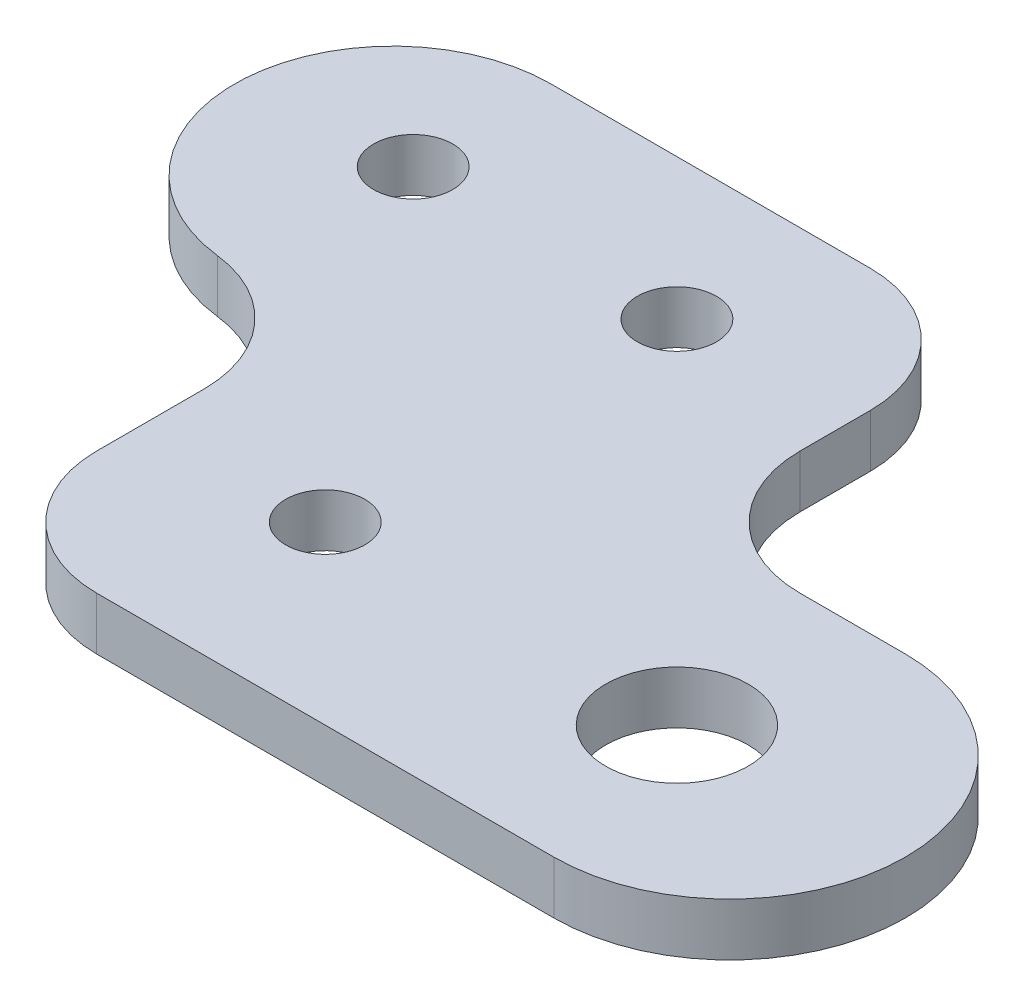
ISO-10303-21;
HEADER;
FILE_DESCRIPTION(('STEP AP214'),'2;1');
FILE_NAME('part.step','',(''),(''),'','','');
FILE_SCHEMA(('AUTOMOTIVE_DESIGN { 1 0 10303 214 1 1 1 1 }'));
ENDSEC;
DATA;
#1=APPLICATION_CONTEXT('core data for automotive mechanical design processes');
#2=APPLICATION_PROTOCOL_DEFINITION('international standard','automotive_design',2000,#1);
#3=PRODUCT_CONTEXT('',#1,'mechanical');
#4=PRODUCT('Part','Part','',(#3));
#5=PRODUCT_RELATED_PRODUCT_CATEGORY('part','',(#4));
#6=PRODUCT_DEFINITION_FORMATION('','',#4);
#7=PRODUCT_DEFINITION_CONTEXT('part definition',#1,'design');
#8=PRODUCT_DEFINITION('design','',#6,#7);
#9=PRODUCT_DEFINITION_SHAPE('','',#8);
#10=(LENGTH_UNIT() NAMED_UNIT(*) SI_UNIT(.MILLI.,.METRE.));
#11=(NAMED_UNIT(*) PLANE_ANGLE_UNIT() SI_UNIT($,.RADIAN.));
#12=(NAMED_UNIT(*) SI_UNIT($,.STERADIAN.) SOLID_ANGLE_UNIT());
#13=UNCERTAINTY_MEASURE_WITH_UNIT(LENGTH_MEASURE(1.E-05),#10,'distance_accuracy_value','');
#14=(GEOMETRIC_REPRESENTATION_CONTEXT(3) GLOBAL_UNCERTAINTY_ASSIGNED_CONTEXT((#13)) GLOBAL_UNIT_ASSIGNED_CONTEXT((#10,
#11,#12)) REPRESENTATION_CONTEXT('',''));
#15=CARTESIAN_POINT('',(0.,0.,0.));
#16=DIRECTION('',(0.,0.,1.));
#17=DIRECTION('',(1.,0.,0.));
#18=AXIS2_PLACEMENT_3D('',#15,#16,#17);
#19=CARTESIAN_POINT('',(6.500000000005,-1.500057886007,13.));
#20=DIRECTION('',(0.,-1.,0.));
#21=DIRECTION('',(0.,0.,-1.));
#22=AXIS2_PLACEMENT_3D('',#19,#20,#21);
#23=PLANE('',#22);
#24=CARTESIAN_POINT('',(16.,-1.500057886007,13.));
#25=DIRECTION('',(0.,-1.,0.));
#26=DIRECTION('',(0.,0.,-1.));
#27=AXIS2_PLACEMENT_3D('',#24,#25,#26);
#28=CIRCLE('',#27,4.05);
#29=CARTESIAN_POINT('',(16.,-1.500057886007,8.95));
#30=VERTEX_POINT('',#29);
#31=EDGE_CURVE('E167',#30,#30,#28,.T.);
#32=ORIENTED_EDGE('',*,*,#31,.T.);
#33=EDGE_LOOP('',(#32));
#34=FACE_BOUND('',#33,.T.);
#35=CARTESIAN_POINT('',(-19.,-1.500057886007,-7.));
#36=DIRECTION('',(0.,-1.,0.));
#37=DIRECTION('',(0.,0.,-1.));
#38=AXIS2_PLACEMENT_3D('',#35,#36,#37);
#39=CIRCLE('',#38,2.25);
#40=CARTESIAN_POINT('',(-19.,-1.500057886007,-9.25));
#41=VERTEX_POINT('',#40);
#42=EDGE_CURVE('E170',#41,#41,#39,.T.);
#43=ORIENTED_EDGE('',*,*,#42,.T.);
#44=EDGE_LOOP('',(#43));
#45=FACE_BOUND('',#44,.T.);
#46=CARTESIAN_POINT('',(-3.999999999995,-1.500057886007,13.));
#47=DIRECTION('',(0.,-1.,0.));
#48=DIRECTION('',(0.,0.,-1.));
#49=AXIS2_PLACEMENT_3D('',#46,#47,#48);
#50=CIRCLE('',#49,2.25);
#51=CARTESIAN_POINT('',(-3.999999999995,-1.500057886007,10.75));
#52=VERTEX_POINT('',#51);
#53=EDGE_CURVE('E173',#52,#52,#50,.T.);
#54=ORIENTED_EDGE('',*,*,#53,.T.);
#55=EDGE_LOOP('',(#54));
#56=FACE_BOUND('',#55,.T.);
#57=CARTESIAN_POINT('',(-3.999999999995,-1.500057886007,-7.));
#58=DIRECTION('',(0.,-1.,0.));
#59=DIRECTION('',(0.,0.,-1.));
#60=AXIS2_PLACEMENT_3D('',#57,#58,#59);
#61=CIRCLE('',#60,2.25);
#62=CARTESIAN_POINT('',(-3.999999999995,-1.500057886007,-9.25));
#63=VERTEX_POINT('',#62);
#64=EDGE_CURVE('E125',#63,#63,#61,.T.);
#65=ORIENTED_EDGE('',*,*,#64,.T.);
#66=EDGE_LOOP('',(#65));
#67=FACE_BOUND('',#66,.T.);
#68=CARTESIAN_POINT('',(-21.,-1.500057886007,9.893847866392));
#69=DIRECTION('',(0.,1.,0.));
#70=DIRECTION('',(0.,0.,1.));
#71=AXIS2_PLACEMENT_3D('',#68,#69,#70);
#72=CIRCLE('',#71,7.);
#73=CARTESIAN_POINT('',(-20.195000000025,-1.500057886007,2.94028942484258));
#74=VERTEX_POINT('',#73);
#75=CARTESIAN_POINT('',(-13.999999999995,-1.500057886007,9.893847866392));
#76=VERTEX_POINT('',#75);
#77=EDGE_CURVE('E133',#74,#76,#72,.F.);
#78=ORIENTED_EDGE('',*,*,#77,.T.);
#79=DIRECTION('',(0.,0.,1.));
#80=VECTOR('',#79,1.);
#81=CARTESIAN_POINT('',(-13.99999999999,-1.500057886007,23.));
#82=LINE('',#81,#80);
#83=CARTESIAN_POINT('',(-13.99999999999,-1.500057886007,16.));
#84=VERTEX_POINT('',#83);
#85=EDGE_CURVE('E130',#84,#76,#82,.F.);
#86=ORIENTED_EDGE('',*,*,#85,.F.);
#87=CARTESIAN_POINT('',(-6.999999999995,-1.500057886007,16.));
#88=DIRECTION('',(0.,1.,0.));
#89=DIRECTION('',(0.,0.,1.));
#90=AXIS2_PLACEMENT_3D('',#87,#88,#89);
#91=CIRCLE('',#90,7.);
#92=CARTESIAN_POINT('',(-6.999999999995,-1.500057886007,23.));
#93=VERTEX_POINT('',#92);
#94=EDGE_CURVE('E187',#93,#84,#91,.F.);
#95=ORIENTED_EDGE('',*,*,#94,.F.);
#96=DIRECTION('',(1.,0.,0.));
#97=VECTOR('',#96,1.);
#98=CARTESIAN_POINT('',(29.,-1.500057886007,23.));
#99=LINE('',#98,#97);
#100=CARTESIAN_POINT('',(19.,-1.500057886007,23.));
#101=VERTEX_POINT('',#100);
#102=EDGE_CURVE('E135',#101,#93,#99,.F.);
#103=ORIENTED_EDGE('',*,*,#102,.F.);
#104=CARTESIAN_POINT('',(19.,-1.500057886007,13.));
#105=DIRECTION('',(0.,-1.,0.));
#106=DIRECTION('',(0.,0.,-1.));
#107=AXIS2_PLACEMENT_3D('',#104,#105,#106);
#108=CIRCLE('',#107,10.);
#109=CARTESIAN_POINT('',(19.,-1.500057886007,3.));
#110=VERTEX_POINT('',#109);
#111=EDGE_CURVE('E110',#110,#101,#108,.T.);
#112=ORIENTED_EDGE('',*,*,#111,.F.);
#113=DIRECTION('',(-1.,0.,0.));
#114=VECTOR('',#113,1.);
#115=CARTESIAN_POINT('',(-15.99999999999,-1.500057886007,3.));
#116=LINE('',#115,#114);
#117=CARTESIAN_POINT('',(13.000000000005,-1.500057886007,3.));
#118=VERTEX_POINT('',#117);
#119=EDGE_CURVE('E108',#118,#110,#116,.F.);
#120=ORIENTED_EDGE('',*,*,#119,.F.);
#121=CARTESIAN_POINT('',(13.00000000001,-1.500057886007,-4.));
#122=DIRECTION('',(0.,-1.,0.));
#123=DIRECTION('',(0.,0.,-1.));
#124=AXIS2_PLACEMENT_3D('',#121,#122,#123);
#125=CIRCLE('',#124,7.);
#126=CARTESIAN_POINT('',(6.000000000005,-1.500057886007,-4.));
#127=VERTEX_POINT('',#126);
#128=EDGE_CURVE('E20',#118,#127,#125,.T.);
#129=ORIENTED_EDGE('',*,*,#128,.T.);
#130=DIRECTION('',(0.,0.,-1.));
#131=VECTOR('',#130,1.);
#132=CARTESIAN_POINT('',(6.000000000005,-1.500057886007,-17.));
#133=LINE('',#132,#131);
#134=CARTESIAN_POINT('',(6.000000000005,-1.500057886007,-8.));
#135=VERTEX_POINT('',#134);
#136=EDGE_CURVE('E123',#135,#127,#133,.F.);
#137=ORIENTED_EDGE('',*,*,#136,.F.);
#138=CARTESIAN_POINT('',(-0.999999999995,-1.500057886007,-8.));
#139=DIRECTION('',(0.,1.,0.));
#140=DIRECTION('',(0.,0.,1.));
#141=AXIS2_PLACEMENT_3D('',#138,#139,#140);
#142=CIRCLE('',#141,7.);
#143=CARTESIAN_POINT('',(-0.999999999994999,-1.500057886007,-15.));
#144=VERTEX_POINT('',#143);
#145=EDGE_CURVE('E178',#144,#135,#142,.F.);
#146=ORIENTED_EDGE('',*,*,#145,.F.);
#147=DIRECTION('',(-1.,0.,0.));
#148=VECTOR('',#147,1.);
#149=CARTESIAN_POINT('',(-28.16,-1.500057886007,-15.));
#150=LINE('',#149,#148);
#151=CARTESIAN_POINT('',(-19.159999999995,-1.500057886007,-15.));
#152=VERTEX_POINT('',#151);
#153=EDGE_CURVE('E126',#152,#144,#150,.F.);
#154=ORIENTED_EDGE('',*,*,#153,.F.);
#155=CARTESIAN_POINT('',(-19.16,-1.500057886007,-6.));
#156=DIRECTION('',(0.,-1.,0.));
#157=DIRECTION('',(0.,0.,-1.));
#158=AXIS2_PLACEMENT_3D('',#155,#156,#157);
#159=CIRCLE('',#158,9.);
#160=EDGE_CURVE('E182',#74,#152,#159,.T.);
#161=ORIENTED_EDGE('',*,*,#160,.F.);
#162=EDGE_LOOP('',(#78,#86,#95,#103,#112,#120,#129,#137,#146,#154,#161));
#163=FACE_BOUND('',#162,.T.);
#164=ADVANCED_FACE('F17',(#34,#45,#56,#67,#163),#23,.F.);
#165=CARTESIAN_POINT('',(13.00000000001,7.422742113993,-4.));
#166=DIRECTION('',(0.,-1.,0.));
#167=DIRECTION('',(0.,0.,-1.));
#168=AXIS2_PLACEMENT_3D('',#165,#166,#167);
#169=CYLINDRICAL_SURFACE('',#168,7.);
#170=ORIENTED_EDGE('',*,*,#128,.F.);
#171=DIRECTION('',(0.,1.,0.));
#172=VECTOR('',#171,1.);
#173=CARTESIAN_POINT('',(13.,-1.500057886007,3.));
#174=LINE('',#173,#172);
#175=CARTESIAN_POINT('',(13.000000000005,-4.500057886007,3.));
#176=VERTEX_POINT('',#175);
#177=EDGE_CURVE('E100',#176,#118,#174,.T.);
#178=ORIENTED_EDGE('',*,*,#177,.F.);
#179=CARTESIAN_POINT('',(13.00000000001,-4.500057886007,-4.));
#180=DIRECTION('',(0.,-1.,0.));
#181=DIRECTION('',(0.,0.,-1.));
#182=AXIS2_PLACEMENT_3D('',#179,#180,#181);
#183=CIRCLE('',#182,7.);
#184=CARTESIAN_POINT('',(6.000000000005,-4.500057886007,-4.));
#185=VERTEX_POINT('',#184);
#186=EDGE_CURVE('E165',#185,#176,#183,.F.);
#187=ORIENTED_EDGE('',*,*,#186,.F.);
#188=DIRECTION('',(0.,1.,0.));
#189=VECTOR('',#188,1.);
#190=CARTESIAN_POINT('',(6.000000000005,-6.500057886007,-4.));
#191=LINE('',#190,#189);
#192=EDGE_CURVE('E103',#127,#185,#191,.F.);
#193=ORIENTED_EDGE('',*,*,#192,.F.);
#194=EDGE_LOOP('',(#170,#178,#187,#193));
#195=FACE_BOUND('',#194,.T.);
#196=ADVANCED_FACE('F98',(#195),#169,.F.);
#197=CARTESIAN_POINT('',(-15.99999999999,-1.500057886007,3.));
#198=DIRECTION('',(0.,0.,-1.));
#199=DIRECTION('',(-1.,0.,0.));
#200=AXIS2_PLACEMENT_3D('',#197,#198,#199);
#201=PLANE('',#200);
#202=ORIENTED_EDGE('',*,*,#177,.T.);
#203=ORIENTED_EDGE('',*,*,#119,.T.);
#204=DIRECTION('',(0.,1.,0.));
#205=VECTOR('',#204,1.);
#206=CARTESIAN_POINT('',(19.,-1.500057886007,3.));
#207=LINE('',#206,#205);
#208=CARTESIAN_POINT('',(19.,-4.500057886007,3.));
#209=VERTEX_POINT('',#208);
#210=EDGE_CURVE('E189',#209,#110,#207,.T.);
#211=ORIENTED_EDGE('',*,*,#210,.F.);
#212=DIRECTION('',(1.,0.,0.));
#213=VECTOR('',#212,1.);
#214=CARTESIAN_POINT('',(6.500000000005,-4.500057886007,3.));
#215=LINE('',#214,#213);
#216=EDGE_CURVE('E116',#176,#209,#215,.T.);
#217=ORIENTED_EDGE('',*,*,#216,.F.);
#218=EDGE_LOOP('',(#202,#203,#211,#217));
#219=FACE_BOUND('',#218,.T.);
#220=ADVANCED_FACE('F114',(#219),#201,.T.);
#221=CARTESIAN_POINT('',(19.,5.017942113993,13.));
#222=DIRECTION('',(0.,-1.,0.));
#223=DIRECTION('',(0.,0.,-1.));
#224=AXIS2_PLACEMENT_3D('',#221,#222,#223);
#225=CYLINDRICAL_SURFACE('',#224,10.);
#226=CARTESIAN_POINT('',(19.,-4.500057886007,13.));
#227=DIRECTION('',(0.,-1.,0.));
#228=DIRECTION('',(0.,0.,-1.));
#229=AXIS2_PLACEMENT_3D('',#226,#227,#228);
#230=CIRCLE('',#229,10.);
#231=CARTESIAN_POINT('',(19.,-4.500057886007,23.));
#232=VERTEX_POINT('',#231);
#233=EDGE_CURVE('E162',#209,#232,#230,.T.);
#234=ORIENTED_EDGE('',*,*,#233,.F.);
#235=ORIENTED_EDGE('',*,*,#210,.T.);
#236=ORIENTED_EDGE('',*,*,#111,.T.);
#237=DIRECTION('',(0.,1.,0.));
#238=VECTOR('',#237,1.);
#239=CARTESIAN_POINT('',(19.,-1.500057886007,23.));
#240=LINE('',#239,#238);
#241=EDGE_CURVE('E121',#232,#101,#240,.T.);
#242=ORIENTED_EDGE('',*,*,#241,.F.);
#243=EDGE_LOOP('',(#234,#235,#236,#242));
#244=FACE_BOUND('',#243,.T.);
#245=ADVANCED_FACE('F192',(#244),#225,.T.);
#246=CARTESIAN_POINT('',(29.,-1.500057886007,23.));
#247=DIRECTION('',(0.,0.,1.));
#248=DIRECTION('',(1.,0.,0.));
#249=AXIS2_PLACEMENT_3D('',#246,#247,#248);
#250=PLANE('',#249);
#251=DIRECTION('',(0.,1.,0.));
#252=VECTOR('',#251,1.);
#253=CARTESIAN_POINT('',(-6.999999999995,-15.42285788601,23.));
#254=LINE('',#253,#252);
#255=CARTESIAN_POINT('',(-6.999999999995,-4.500057886007,23.));
#256=VERTEX_POINT('',#255);
#257=EDGE_CURVE('E136',#256,#93,#254,.T.);
#258=ORIENTED_EDGE('',*,*,#257,.F.);
#259=DIRECTION('',(1.,0.,0.));
#260=VECTOR('',#259,1.);
#261=CARTESIAN_POINT('',(6.500000000005,-4.500057886007,23.));
#262=LINE('',#261,#260);
#263=EDGE_CURVE('E161',#232,#256,#262,.F.);
#264=ORIENTED_EDGE('',*,*,#263,.F.);
#265=ORIENTED_EDGE('',*,*,#241,.T.);
#266=ORIENTED_EDGE('',*,*,#102,.T.);
#267=EDGE_LOOP('',(#258,#264,#265,#266));
#268=FACE_BOUND('',#267,.T.);
#269=ADVANCED_FACE('F199',(#268),#250,.T.);
#270=CARTESIAN_POINT('',(-6.999999999995,-15.42285788601,16.));
#271=DIRECTION('',(0.,1.,0.));
#272=DIRECTION('',(0.,0.,1.));
#273=AXIS2_PLACEMENT_3D('',#270,#271,#272);
#274=CYLINDRICAL_SURFACE('',#273,7.);
#275=ORIENTED_EDGE('',*,*,#94,.T.);
#276=DIRECTION('',(0.,1.,0.));
#277=VECTOR('',#276,1.);
#278=CARTESIAN_POINT('',(-13.99999999999,-1.500057886007,16.));
#279=LINE('',#278,#277);
#280=CARTESIAN_POINT('',(-13.999999999995,-4.500057886007,16.));
#281=VERTEX_POINT('',#280);
#282=EDGE_CURVE('E134',#281,#84,#279,.T.);
#283=ORIENTED_EDGE('',*,*,#282,.F.);
#284=CARTESIAN_POINT('',(-6.999999999995,-4.500057886007,16.));
#285=DIRECTION('',(0.,1.,0.));
#286=DIRECTION('',(0.,0.,1.));
#287=AXIS2_PLACEMENT_3D('',#284,#285,#286);
#288=CIRCLE('',#287,7.);
#289=EDGE_CURVE('E158',#256,#281,#288,.F.);
#290=ORIENTED_EDGE('',*,*,#289,.F.);
#291=ORIENTED_EDGE('',*,*,#257,.T.);
#292=EDGE_LOOP('',(#275,#283,#290,#291));
#293=FACE_BOUND('',#292,.T.);
#294=ADVANCED_FACE('F218',(#293),#274,.T.);
#295=CARTESIAN_POINT('',(-13.99999999999,-1.500057886007,23.));
#296=DIRECTION('',(-1.,0.,0.));
#297=DIRECTION('',(0.,0.,1.));
#298=AXIS2_PLACEMENT_3D('',#295,#296,#297);
#299=PLANE('',#298);
#300=ORIENTED_EDGE('',*,*,#282,.T.);
#301=ORIENTED_EDGE('',*,*,#85,.T.);
#302=DIRECTION('',(0.,1.,0.));
#303=VECTOR('',#302,1.);
#304=CARTESIAN_POINT('',(-14.,-15.42285788601,9.893847866392));
#305=LINE('',#304,#303);
#306=CARTESIAN_POINT('',(-14.,-4.500057886007,9.893847866392));
#307=VERTEX_POINT('',#306);
#308=EDGE_CURVE('E186',#76,#307,#305,.F.);
#309=ORIENTED_EDGE('',*,*,#308,.T.);
#310=DIRECTION('',(0.,0.,-1.));
#311=VECTOR('',#310,1.);
#312=CARTESIAN_POINT('',(-14.,-4.500057886007,13.));
#313=LINE('',#312,#311);
#314=EDGE_CURVE('E157',#281,#307,#313,.T.);
#315=ORIENTED_EDGE('',*,*,#314,.F.);
#316=EDGE_LOOP('',(#300,#301,#309,#315));
#317=FACE_BOUND('',#316,.T.);
#318=ADVANCED_FACE('F240',(#317),#299,.T.);
#319=CARTESIAN_POINT('',(-21.,-15.42285788601,9.893847866392));
#320=DIRECTION('',(0.,1.,0.));
#321=DIRECTION('',(0.,0.,1.));
#322=AXIS2_PLACEMENT_3D('',#319,#320,#321);
#323=CYLINDRICAL_SURFACE('',#322,7.);
#324=CARTESIAN_POINT('',(-21.,-4.500057886007,9.893847866392));
#325=DIRECTION('',(0.,1.,0.));
#326=DIRECTION('',(0.,0.,1.));
#327=AXIS2_PLACEMENT_3D('',#324,#325,#326);
#328=CIRCLE('',#327,7.);
#329=CARTESIAN_POINT('',(-20.195000000025,-4.500057886007,2.94028942484237));
#330=VERTEX_POINT('',#329);
#331=EDGE_CURVE('E154',#307,#330,#328,.T.);
#332=ORIENTED_EDGE('',*,*,#331,.F.);
#333=ORIENTED_EDGE('',*,*,#308,.F.);
#334=ORIENTED_EDGE('',*,*,#77,.F.);
#335=DIRECTION('',(0.,-1.,0.));
#336=VECTOR('',#335,1.);
#337=CARTESIAN_POINT('',(-20.1950000000499,5.017942113993,2.94028942483948));
#338=LINE('',#337,#336);
#339=EDGE_CURVE('E184',#330,#74,#338,.F.);
#340=ORIENTED_EDGE('',*,*,#339,.F.);
#341=EDGE_LOOP('',(#332,#333,#334,#340));
#342=FACE_BOUND('',#341,.T.);
#343=ADVANCED_FACE('F241',(#342),#323,.F.);
#344=CARTESIAN_POINT('',(-19.16,5.017942113993,-6.));
#345=DIRECTION('',(0.,-1.,0.));
#346=DIRECTION('',(0.,0.,-1.));
#347=AXIS2_PLACEMENT_3D('',#344,#345,#346);
#348=CYLINDRICAL_SURFACE('',#347,9.);
#349=ORIENTED_EDGE('',*,*,#339,.T.);
#350=ORIENTED_EDGE('',*,*,#160,.T.);
#351=DIRECTION('',(0.,1.,0.));
#352=VECTOR('',#351,1.);
#353=CARTESIAN_POINT('',(-19.15999999999,-6.500057886007,-15.));
#354=LINE('',#353,#352);
#355=CARTESIAN_POINT('',(-19.159999999995,-4.500057886007,-15.));
#356=VERTEX_POINT('',#355);
#357=EDGE_CURVE('E129',#356,#152,#354,.T.);
#358=ORIENTED_EDGE('',*,*,#357,.F.);
#359=CARTESIAN_POINT('',(-19.16,-4.500057886007,-6.));
#360=DIRECTION('',(0.,-1.,0.));
#361=DIRECTION('',(0.,0.,-1.));
#362=AXIS2_PLACEMENT_3D('',#359,#360,#361);
#363=CIRCLE('',#362,9.);
#364=EDGE_CURVE('E151',#330,#356,#363,.T.);
#365=ORIENTED_EDGE('',*,*,#364,.F.);
#366=EDGE_LOOP('',(#349,#350,#358,#365));
#367=FACE_BOUND('',#366,.T.);
#368=ADVANCED_FACE('F237',(#367),#348,.T.);
#369=CARTESIAN_POINT('',(-28.16,-6.500057886007,-15.));
#370=DIRECTION('',(0.,0.,-1.));
#371=DIRECTION('',(-1.,0.,0.));
#372=AXIS2_PLACEMENT_3D('',#369,#370,#371);
#373=PLANE('',#372);
#374=DIRECTION('',(0.,1.,0.));
#375=VECTOR('',#374,1.);
#376=CARTESIAN_POINT('',(-0.999999999994999,-15.42285788601,-15.));
#377=LINE('',#376,#375);
#378=CARTESIAN_POINT('',(-0.999999999995,-4.500057886007,-15.));
#379=VERTEX_POINT('',#378);
#380=EDGE_CURVE('E128',#379,#144,#377,.T.);
#381=ORIENTED_EDGE('',*,*,#380,.F.);
#382=DIRECTION('',(1.,0.,0.));
#383=VECTOR('',#382,1.);
#384=CARTESIAN_POINT('',(6.500000000005,-4.500057886007,-15.));
#385=LINE('',#384,#383);
#386=EDGE_CURVE('E150',#356,#379,#385,.T.);
#387=ORIENTED_EDGE('',*,*,#386,.F.);
#388=ORIENTED_EDGE('',*,*,#357,.T.);
#389=ORIENTED_EDGE('',*,*,#153,.T.);
#390=EDGE_LOOP('',(#381,#387,#388,#389));
#391=FACE_BOUND('',#390,.T.);
#392=ADVANCED_FACE('F234',(#391),#373,.T.);
#393=CARTESIAN_POINT('',(-0.999999999995,-15.42285788601,-8.));
#394=DIRECTION('',(0.,1.,0.));
#395=DIRECTION('',(0.,0.,1.));
#396=AXIS2_PLACEMENT_3D('',#393,#394,#395);
#397=CYLINDRICAL_SURFACE('',#396,7.);
#398=ORIENTED_EDGE('',*,*,#145,.T.);
#399=DIRECTION('',(0.,1.,0.));
#400=VECTOR('',#399,1.);
#401=CARTESIAN_POINT('',(6.000000000005,-6.500057886007,-8.));
#402=LINE('',#401,#400);
#403=CARTESIAN_POINT('',(6.000000000005,-4.500057886007,-8.));
#404=VERTEX_POINT('',#403);
#405=EDGE_CURVE('E35',#404,#135,#402,.T.);
#406=ORIENTED_EDGE('',*,*,#405,.F.);
#407=CARTESIAN_POINT('',(-0.999999999995,-4.500057886007,-8.));
#408=DIRECTION('',(0.,1.,0.));
#409=DIRECTION('',(0.,0.,1.));
#410=AXIS2_PLACEMENT_3D('',#407,#408,#409);
#411=CIRCLE('',#410,7.);
#412=EDGE_CURVE('E147',#379,#404,#411,.F.);
#413=ORIENTED_EDGE('',*,*,#412,.F.);
#414=ORIENTED_EDGE('',*,*,#380,.T.);
#415=EDGE_LOOP('',(#398,#406,#413,#414));
#416=FACE_BOUND('',#415,.T.);
#417=ADVANCED_FACE('F231',(#416),#397,.T.);
#418=CARTESIAN_POINT('',(6.000000000005,-6.500057886007,-17.));
#419=DIRECTION('',(1.,0.,0.));
#420=DIRECTION('',(0.,0.,-1.));
#421=AXIS2_PLACEMENT_3D('',#418,#419,#420);
#422=PLANE('',#421);
#423=ORIENTED_EDGE('',*,*,#405,.T.);
#424=ORIENTED_EDGE('',*,*,#136,.T.);
#425=ORIENTED_EDGE('',*,*,#192,.T.);
#426=DIRECTION('',(0.,0.,-1.));
#427=VECTOR('',#426,1.);
#428=CARTESIAN_POINT('',(6.000000000005,-4.500057886007,13.));
#429=LINE('',#428,#427);
#430=EDGE_CURVE('E146',#404,#185,#429,.F.);
#431=ORIENTED_EDGE('',*,*,#430,.F.);
#432=EDGE_LOOP('',(#423,#424,#425,#431));
#433=FACE_BOUND('',#432,.T.);
#434=ADVANCED_FACE('F227',(#433),#422,.T.);
#435=CARTESIAN_POINT('',(-3.999999999995,-6.500057886007,-7.));
#436=DIRECTION('',(0.,-1.,0.));
#437=DIRECTION('',(0.,0.,-1.));
#438=AXIS2_PLACEMENT_3D('',#435,#436,#437);
#439=CYLINDRICAL_SURFACE('',#438,2.25);
#440=CARTESIAN_POINT('',(-3.999999999995,-4.500057886007,-7.));
#441=DIRECTION('',(0.,-1.,0.));
#442=DIRECTION('',(0.,0.,-1.));
#443=AXIS2_PLACEMENT_3D('',#440,#441,#442);
#444=CIRCLE('',#443,2.25);
#445=CARTESIAN_POINT('',(-3.999999999995,-4.500057886007,-9.25));
#446=VERTEX_POINT('',#445);
#447=EDGE_CURVE('E143',#446,#446,#444,.F.);
#448=ORIENTED_EDGE('',*,*,#447,.F.);
#449=EDGE_LOOP('',(#448));
#450=FACE_BOUND('',#449,.T.);
#451=ORIENTED_EDGE('',*,*,#64,.F.);
#452=EDGE_LOOP('',(#451));
#453=FACE_BOUND('',#452,.T.);
#454=ADVANCED_FACE('F269',(#450,#453),#439,.F.);
#455=CARTESIAN_POINT('',(-3.999999999995,-1.500057886007,13.));
#456=DIRECTION('',(0.,-1.,0.));
#457=DIRECTION('',(0.,0.,-1.));
#458=AXIS2_PLACEMENT_3D('',#455,#456,#457);
#459=CYLINDRICAL_SURFACE('',#458,2.25);
#460=CARTESIAN_POINT('',(-3.999999999995,-4.500057886007,13.));
#461=DIRECTION('',(0.,-1.,0.));
#462=DIRECTION('',(0.,0.,-1.));
#463=AXIS2_PLACEMENT_3D('',#460,#461,#462);
#464=CIRCLE('',#463,2.25);
#465=CARTESIAN_POINT('',(-3.999999999995,-4.500057886007,10.75));
#466=VERTEX_POINT('',#465);
#467=EDGE_CURVE('E140',#466,#466,#464,.F.);
#468=ORIENTED_EDGE('',*,*,#467,.F.);
#469=EDGE_LOOP('',(#468));
#470=FACE_BOUND('',#469,.T.);
#471=ORIENTED_EDGE('',*,*,#53,.F.);
#472=EDGE_LOOP('',(#471));
#473=FACE_BOUND('',#472,.T.);
#474=ADVANCED_FACE('F265',(#470,#473),#459,.F.);
#475=CARTESIAN_POINT('',(-19.,-6.500057886007,-7.));
#476=DIRECTION('',(0.,-1.,0.));
#477=DIRECTION('',(0.,0.,-1.));
#478=AXIS2_PLACEMENT_3D('',#475,#476,#477);
#479=CYLINDRICAL_SURFACE('',#478,2.25);
#480=CARTESIAN_POINT('',(-19.,-4.500057886007,-7.));
#481=DIRECTION('',(0.,-1.,0.));
#482=DIRECTION('',(0.,0.,-1.));
#483=AXIS2_PLACEMENT_3D('',#480,#481,#482);
#484=CIRCLE('',#483,2.25);
#485=CARTESIAN_POINT('',(-19.,-4.500057886007,-9.25));
#486=VERTEX_POINT('',#485);
#487=EDGE_CURVE('E26',#486,#486,#484,.F.);
#488=ORIENTED_EDGE('',*,*,#487,.F.);
#489=EDGE_LOOP('',(#488));
#490=FACE_BOUND('',#489,.T.);
#491=ORIENTED_EDGE('',*,*,#42,.F.);
#492=EDGE_LOOP('',(#491));
#493=FACE_BOUND('',#492,.T.);
#494=ADVANCED_FACE('F258',(#490,#493),#479,.F.);
#495=CARTESIAN_POINT('',(16.,-6.500057886007,13.));
#496=DIRECTION('',(0.,-1.,0.));
#497=DIRECTION('',(0.,0.,-1.));
#498=AXIS2_PLACEMENT_3D('',#495,#496,#497);
#499=CYLINDRICAL_SURFACE('',#498,4.05);
#500=ORIENTED_EDGE('',*,*,#31,.F.);
#501=EDGE_LOOP('',(#500));
#502=FACE_BOUND('',#501,.T.);
#503=CARTESIAN_POINT('',(16.,-4.500057886007,13.));
#504=DIRECTION('',(0.,-1.,0.));
#505=DIRECTION('',(0.,0.,-1.));
#506=AXIS2_PLACEMENT_3D('',#503,#504,#505);
#507=CIRCLE('',#506,4.05);
#508=CARTESIAN_POINT('',(16.,-4.500057886007,8.95));
#509=VERTEX_POINT('',#508);
#510=EDGE_CURVE('E10',#509,#509,#507,.F.);
#511=ORIENTED_EDGE('',*,*,#510,.F.);
#512=EDGE_LOOP('',(#511));
#513=FACE_BOUND('',#512,.T.);
#514=ADVANCED_FACE('F252',(#502,#513),#499,.F.);
#515=CARTESIAN_POINT('',(6.500000000005,-4.500057886007,13.));
#516=DIRECTION('',(0.,-1.,0.));
#517=DIRECTION('',(0.,0.,-1.));
#518=AXIS2_PLACEMENT_3D('',#515,#516,#517);
#519=PLANE('',#518);
#520=ORIENTED_EDGE('',*,*,#510,.T.);
#521=EDGE_LOOP('',(#520));
#522=FACE_BOUND('',#521,.T.);
#523=ORIENTED_EDGE('',*,*,#487,.T.);
#524=EDGE_LOOP('',(#523));
#525=FACE_BOUND('',#524,.T.);
#526=ORIENTED_EDGE('',*,*,#467,.T.);
#527=EDGE_LOOP('',(#526));
#528=FACE_BOUND('',#527,.T.);
#529=ORIENTED_EDGE('',*,*,#447,.T.);
#530=EDGE_LOOP('',(#529));
#531=FACE_BOUND('',#530,.T.);
#532=ORIENTED_EDGE('',*,*,#412,.T.);
#533=ORIENTED_EDGE('',*,*,#430,.T.);
#534=ORIENTED_EDGE('',*,*,#186,.T.);
#535=ORIENTED_EDGE('',*,*,#216,.T.);
#536=ORIENTED_EDGE('',*,*,#233,.T.);
#537=ORIENTED_EDGE('',*,*,#263,.T.);
#538=ORIENTED_EDGE('',*,*,#289,.T.);
#539=ORIENTED_EDGE('',*,*,#314,.T.);
#540=ORIENTED_EDGE('',*,*,#331,.T.);
#541=ORIENTED_EDGE('',*,*,#364,.T.);
#542=ORIENTED_EDGE('',*,*,#386,.T.);
#543=EDGE_LOOP('',(#532,#533,#534,#535,#536,#537,#538,#539,#540,#541,#542));
#544=FACE_BOUND('',#543,.T.);
#545=ADVANCED_FACE('F204',(#522,#525,#528,#531,#544),#519,.T.);
#546=CLOSED_SHELL('',(#164,#196,#220,#245,#269,#294,#318,#343,#368,#392,#417,#434,#454,#474,
#494,#514,#545));
#547=MANIFOLD_SOLID_BREP('B1',#546);
#548=ADVANCED_BREP_SHAPE_REPRESENTATION('',(#18,#547),#14);
#549=SHAPE_DEFINITION_REPRESENTATION(#9,#548);
ENDSEC;
END-ISO-10303-21;
